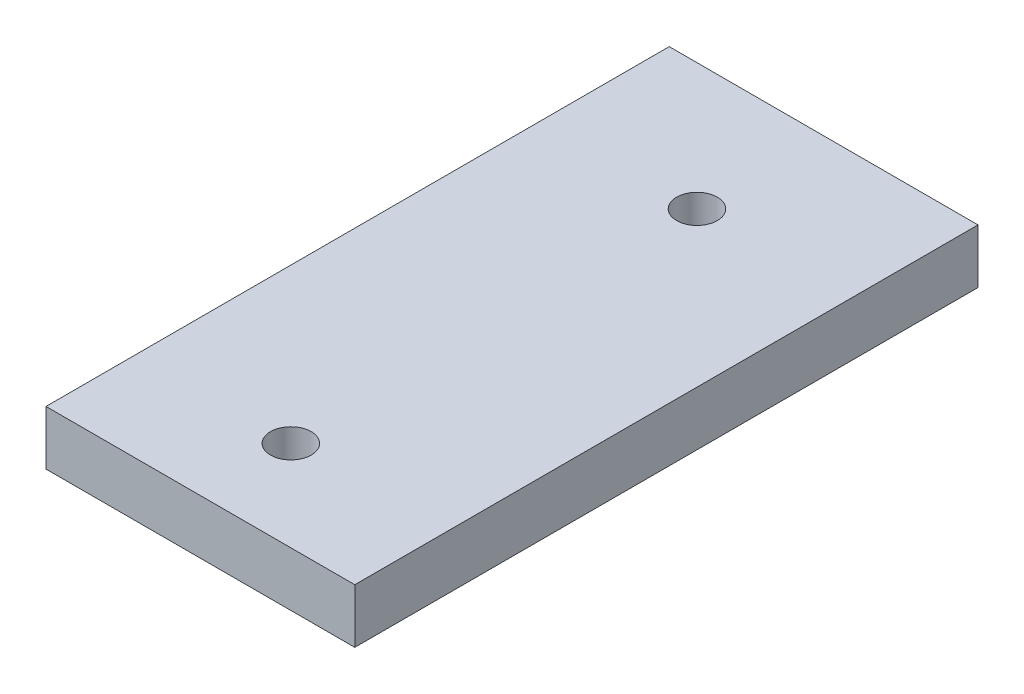
ISO-10303-21;
HEADER;
FILE_DESCRIPTION(('STEP AP214'),'2;1');
FILE_NAME('part.step','',(''),(''),'','','');
FILE_SCHEMA(('AUTOMOTIVE_DESIGN { 1 0 10303 214 1 1 1 1 }'));
ENDSEC;
DATA;
#1=APPLICATION_CONTEXT('core data for automotive mechanical design processes');
#2=APPLICATION_PROTOCOL_DEFINITION('international standard','automotive_design',2000,#1);
#3=PRODUCT_CONTEXT('',#1,'mechanical');
#4=PRODUCT('Part','Part','',(#3));
#5=PRODUCT_RELATED_PRODUCT_CATEGORY('part','',(#4));
#6=PRODUCT_DEFINITION_FORMATION('','',#4);
#7=PRODUCT_DEFINITION_CONTEXT('part definition',#1,'design');
#8=PRODUCT_DEFINITION('design','',#6,#7);
#9=PRODUCT_DEFINITION_SHAPE('','',#8);
#10=(LENGTH_UNIT() NAMED_UNIT(*) SI_UNIT(.MILLI.,.METRE.));
#11=(NAMED_UNIT(*) PLANE_ANGLE_UNIT() SI_UNIT($,.RADIAN.));
#12=(NAMED_UNIT(*) SI_UNIT($,.STERADIAN.) SOLID_ANGLE_UNIT());
#13=UNCERTAINTY_MEASURE_WITH_UNIT(LENGTH_MEASURE(1.E-05),#10,'distance_accuracy_value','');
#14=(GEOMETRIC_REPRESENTATION_CONTEXT(3) GLOBAL_UNCERTAINTY_ASSIGNED_CONTEXT((#13)) GLOBAL_UNIT_ASSIGNED_CONTEXT((#10,
#11,#12)) REPRESENTATION_CONTEXT('',''));
#15=CARTESIAN_POINT('',(0.,0.,0.));
#16=DIRECTION('',(0.,0.,1.));
#17=DIRECTION('',(1.,0.,0.));
#18=AXIS2_PLACEMENT_3D('',#15,#16,#17);
#19=CARTESIAN_POINT('',(-14.7857903175384,6.,27.8964411930227));
#20=DIRECTION('',(1.,0.,0.));
#21=DIRECTION('',(0.,0.,-1.));
#22=AXIS2_PLACEMENT_3D('',#19,#20,#21);
#23=PLANE('',#22);
#24=DIRECTION('',(0.,0.,1.));
#25=VECTOR('',#24,1.);
#26=CARTESIAN_POINT('',(-14.7857903175384,0.,27.8964411930227));
#27=LINE('',#26,#25);
#28=CARTESIAN_POINT('',(-14.7857903175384,0.,-40.9995648649035));
#29=VERTEX_POINT('',#28);
#30=CARTESIAN_POINT('',(-14.7857903175384,0.,27.8964411930227));
#31=VERTEX_POINT('',#30);
#32=EDGE_CURVE('E95',#29,#31,#27,.T.);
#33=ORIENTED_EDGE('',*,*,#32,.T.);
#34=DIRECTION('',(0.,-1.,0.));
#35=VECTOR('',#34,1.);
#36=CARTESIAN_POINT('',(-14.7857903175384,6.,27.8964411930227));
#37=LINE('',#36,#35);
#38=CARTESIAN_POINT('',(-14.7857903175384,6.,27.8964411930227));
#39=VERTEX_POINT('',#38);
#40=EDGE_CURVE('E11',#39,#31,#37,.T.);
#41=ORIENTED_EDGE('',*,*,#40,.F.);
#42=DIRECTION('',(0.,0.,1.));
#43=VECTOR('',#42,1.);
#44=CARTESIAN_POINT('',(-14.7857903175384,6.,27.8964411930227));
#45=LINE('',#44,#43);
#46=CARTESIAN_POINT('',(-14.7857903175384,6.,-40.9995648649035));
#47=VERTEX_POINT('',#46);
#48=EDGE_CURVE('E83',#47,#39,#45,.T.);
#49=ORIENTED_EDGE('',*,*,#48,.F.);
#50=DIRECTION('',(0.,-1.,0.));
#51=VECTOR('',#50,1.);
#52=CARTESIAN_POINT('',(-14.7857903175384,6.,-40.9995648649035));
#53=LINE('',#52,#51);
#54=EDGE_CURVE('E91',#47,#29,#53,.T.);
#55=ORIENTED_EDGE('',*,*,#54,.T.);
#56=EDGE_LOOP('',(#33,#41,#49,#55));
#57=FACE_BOUND('',#56,.T.);
#58=ADVANCED_FACE('F32',(#57),#23,.F.);
#59=CARTESIAN_POINT('',(-14.7857903175384,6.,27.8964411930227));
#60=DIRECTION('',(0.,0.,-1.));
#61=DIRECTION('',(-1.,0.,0.));
#62=AXIS2_PLACEMENT_3D('',#59,#60,#61);
#63=PLANE('',#62);
#64=DIRECTION('',(1.,0.,0.));
#65=VECTOR('',#64,1.);
#66=CARTESIAN_POINT('',(-14.7857903175384,0.,27.8964411930227));
#67=LINE('',#66,#65);
#68=CARTESIAN_POINT('',(19.3495711070007,0.,27.8964411930227));
#69=VERTEX_POINT('',#68);
#70=EDGE_CURVE('E87',#31,#69,#67,.T.);
#71=ORIENTED_EDGE('',*,*,#70,.T.);
#72=DIRECTION('',(0.,-1.,0.));
#73=VECTOR('',#72,1.);
#74=CARTESIAN_POINT('',(19.3495711070007,6.,27.8964411930227));
#75=LINE('',#74,#73);
#76=CARTESIAN_POINT('',(19.3495711070007,6.,27.8964411930227));
#77=VERTEX_POINT('',#76);
#78=EDGE_CURVE('E40',#77,#69,#75,.T.);
#79=ORIENTED_EDGE('',*,*,#78,.F.);
#80=DIRECTION('',(1.,0.,0.));
#81=VECTOR('',#80,1.);
#82=CARTESIAN_POINT('',(-14.7857903175384,6.,27.8964411930227));
#83=LINE('',#82,#81);
#84=EDGE_CURVE('E78',#39,#77,#83,.T.);
#85=ORIENTED_EDGE('',*,*,#84,.F.);
#86=ORIENTED_EDGE('',*,*,#40,.T.);
#87=EDGE_LOOP('',(#71,#79,#85,#86));
#88=FACE_BOUND('',#87,.T.);
#89=ADVANCED_FACE('F86',(#88),#63,.F.);
#90=CARTESIAN_POINT('',(19.3495711070007,6.,27.8964411930227));
#91=DIRECTION('',(-1.,0.,0.));
#92=DIRECTION('',(0.,0.,1.));
#93=AXIS2_PLACEMENT_3D('',#90,#91,#92);
#94=PLANE('',#93);
#95=DIRECTION('',(0.,0.,-1.));
#96=VECTOR('',#95,1.);
#97=CARTESIAN_POINT('',(19.3495711070007,0.,27.8964411930227));
#98=LINE('',#97,#96);
#99=CARTESIAN_POINT('',(19.3495711070007,0.,-40.9995648649035));
#100=VERTEX_POINT('',#99);
#101=EDGE_CURVE('E65',#69,#100,#98,.T.);
#102=ORIENTED_EDGE('',*,*,#101,.T.);
#103=DIRECTION('',(0.,-1.,0.));
#104=VECTOR('',#103,1.);
#105=CARTESIAN_POINT('',(19.3495711070007,6.,-40.9995648649035));
#106=LINE('',#105,#104);
#107=CARTESIAN_POINT('',(19.3495711070007,6.,-40.9995648649035));
#108=VERTEX_POINT('',#107);
#109=EDGE_CURVE('E88',#108,#100,#106,.T.);
#110=ORIENTED_EDGE('',*,*,#109,.F.);
#111=DIRECTION('',(0.,0.,-1.));
#112=VECTOR('',#111,1.);
#113=CARTESIAN_POINT('',(19.3495711070007,6.,27.8964411930227));
#114=LINE('',#113,#112);
#115=EDGE_CURVE('E81',#77,#108,#114,.T.);
#116=ORIENTED_EDGE('',*,*,#115,.F.);
#117=ORIENTED_EDGE('',*,*,#78,.T.);
#118=EDGE_LOOP('',(#102,#110,#116,#117));
#119=FACE_BOUND('',#118,.T.);
#120=ADVANCED_FACE('F89',(#119),#94,.F.);
#121=CARTESIAN_POINT('',(-14.7857903175384,6.,-40.9995648649035));
#122=DIRECTION('',(0.,0.,1.));
#123=DIRECTION('',(1.,0.,0.));
#124=AXIS2_PLACEMENT_3D('',#121,#122,#123);
#125=PLANE('',#124);
#126=DIRECTION('',(-1.,0.,0.));
#127=VECTOR('',#126,1.);
#128=CARTESIAN_POINT('',(-14.7857903175384,0.,-40.9995648649035));
#129=LINE('',#128,#127);
#130=EDGE_CURVE('E71',#100,#29,#129,.T.);
#131=ORIENTED_EDGE('',*,*,#130,.T.);
#132=ORIENTED_EDGE('',*,*,#54,.F.);
#133=DIRECTION('',(-1.,0.,0.));
#134=VECTOR('',#133,1.);
#135=CARTESIAN_POINT('',(-14.7857903175384,6.,-40.9995648649035));
#136=LINE('',#135,#134);
#137=EDGE_CURVE('E48',#108,#47,#136,.T.);
#138=ORIENTED_EDGE('',*,*,#137,.F.);
#139=ORIENTED_EDGE('',*,*,#109,.T.);
#140=EDGE_LOOP('',(#131,#132,#138,#139));
#141=FACE_BOUND('',#140,.T.);
#142=ADVANCED_FACE('F103',(#141),#125,.F.);
#143=CARTESIAN_POINT('',(0.,6.,0.));
#144=DIRECTION('',(0.,-1.,0.));
#145=DIRECTION('',(0.,0.,-1.));
#146=AXIS2_PLACEMENT_3D('',#143,#144,#145);
#147=PLANE('',#146);
#148=CARTESIAN_POINT('',(2.28189039473115,6.,17.8964411930227));
#149=DIRECTION('',(0.,1.,0.));
#150=DIRECTION('',(0.,0.,1.));
#151=AXIS2_PLACEMENT_3D('',#148,#149,#150);
#152=CIRCLE('',#151,2.25);
#153=CARTESIAN_POINT('',(2.28189039473115,6.,20.1464411930227));
#154=VERTEX_POINT('',#153);
#155=EDGE_CURVE('E98',#154,#154,#152,.T.);
#156=ORIENTED_EDGE('',*,*,#155,.F.);
#157=EDGE_LOOP('',(#156));
#158=FACE_BOUND('',#157,.T.);
#159=CARTESIAN_POINT('',(2.28189039473115,6.,-26.9995648649035));
#160=DIRECTION('',(0.,1.,0.));
#161=DIRECTION('',(0.,0.,1.));
#162=AXIS2_PLACEMENT_3D('',#159,#160,#161);
#163=CIRCLE('',#162,2.25);
#164=CARTESIAN_POINT('',(2.28189039473115,6.,-24.7495648649035));
#165=VERTEX_POINT('',#164);
#166=EDGE_CURVE('E112',#165,#165,#163,.T.);
#167=ORIENTED_EDGE('',*,*,#166,.F.);
#168=EDGE_LOOP('',(#167));
#169=FACE_BOUND('',#168,.T.);
#170=ORIENTED_EDGE('',*,*,#48,.T.);
#171=ORIENTED_EDGE('',*,*,#84,.T.);
#172=ORIENTED_EDGE('',*,*,#115,.T.);
#173=ORIENTED_EDGE('',*,*,#137,.T.);
#174=EDGE_LOOP('',(#170,#171,#172,#173));
#175=FACE_BOUND('',#174,.T.);
#176=ADVANCED_FACE('F79',(#158,#169,#175),#147,.F.);
#177=CARTESIAN_POINT('',(0.,0.,0.));
#178=DIRECTION('',(0.,-1.,0.));
#179=DIRECTION('',(0.,0.,-1.));
#180=AXIS2_PLACEMENT_3D('',#177,#178,#179);
#181=PLANE('',#180);
#182=CARTESIAN_POINT('',(2.28189039473115,0.,17.8964411930227));
#183=DIRECTION('',(0.,-1.,0.));
#184=DIRECTION('',(0.,0.,-1.));
#185=AXIS2_PLACEMENT_3D('',#182,#183,#184);
#186=CIRCLE('',#185,2.25);
#187=CARTESIAN_POINT('',(2.28189039473115,0.,15.6464411930227));
#188=VERTEX_POINT('',#187);
#189=EDGE_CURVE('E115',#188,#188,#186,.F.);
#190=ORIENTED_EDGE('',*,*,#189,.T.);
#191=EDGE_LOOP('',(#190));
#192=FACE_BOUND('',#191,.T.);
#193=CARTESIAN_POINT('',(2.28189039473115,0.,-26.9995648649035));
#194=DIRECTION('',(0.,-1.,0.));
#195=DIRECTION('',(0.,0.,-1.));
#196=AXIS2_PLACEMENT_3D('',#193,#194,#195);
#197=CIRCLE('',#196,2.25);
#198=CARTESIAN_POINT('',(2.28189039473115,0.,-29.2495648649035));
#199=VERTEX_POINT('',#198);
#200=EDGE_CURVE('E109',#199,#199,#197,.F.);
#201=ORIENTED_EDGE('',*,*,#200,.T.);
#202=EDGE_LOOP('',(#201));
#203=FACE_BOUND('',#202,.T.);
#204=ORIENTED_EDGE('',*,*,#32,.F.);
#205=ORIENTED_EDGE('',*,*,#130,.F.);
#206=ORIENTED_EDGE('',*,*,#101,.F.);
#207=ORIENTED_EDGE('',*,*,#70,.F.);
#208=EDGE_LOOP('',(#204,#205,#206,#207));
#209=FACE_BOUND('',#208,.T.);
#210=ADVANCED_FACE('F106',(#192,#203,#209),#181,.T.);
#211=CARTESIAN_POINT('',(2.28189039473115,-0.00100000000000013,-26.9995648649035));
#212=DIRECTION('',(0.,1.,0.));
#213=DIRECTION('',(0.,0.,1.));
#214=AXIS2_PLACEMENT_3D('',#211,#212,#213);
#215=CYLINDRICAL_SURFACE('',#214,2.25);
#216=ORIENTED_EDGE('',*,*,#200,.F.);
#217=EDGE_LOOP('',(#216));
#218=FACE_BOUND('',#217,.T.);
#219=ORIENTED_EDGE('',*,*,#166,.T.);
#220=EDGE_LOOP('',(#219));
#221=FACE_BOUND('',#220,.T.);
#222=ADVANCED_FACE('F128',(#218,#221),#215,.F.);
#223=CARTESIAN_POINT('',(2.28189039473115,-0.00100000000000013,17.8964411930227));
#224=DIRECTION('',(0.,1.,0.));
#225=DIRECTION('',(0.,0.,1.));
#226=AXIS2_PLACEMENT_3D('',#223,#224,#225);
#227=CYLINDRICAL_SURFACE('',#226,2.25);
#228=ORIENTED_EDGE('',*,*,#189,.F.);
#229=EDGE_LOOP('',(#228));
#230=FACE_BOUND('',#229,.T.);
#231=ORIENTED_EDGE('',*,*,#155,.T.);
#232=EDGE_LOOP('',(#231));
#233=FACE_BOUND('',#232,.T.);
#234=ADVANCED_FACE('F121',(#230,#233),#227,.F.);
#235=CLOSED_SHELL('',(#58,#89,#120,#142,#176,#210,#222,#234));
#236=MANIFOLD_SOLID_BREP('B2',#235);
#237=ADVANCED_BREP_SHAPE_REPRESENTATION('',(#18,#236),#14);
#238=SHAPE_DEFINITION_REPRESENTATION(#9,#237);
ENDSEC;
END-ISO-10303-21;
